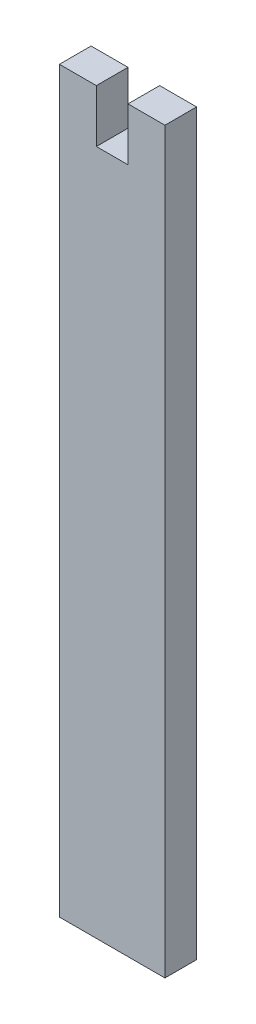
ISO-10303-21;
HEADER;
FILE_DESCRIPTION(('STEP AP214'),'2;1');
FILE_NAME('part.step','',(''),(''),'','','');
FILE_SCHEMA(('AUTOMOTIVE_DESIGN { 1 0 10303 214 1 1 1 1 }'));
ENDSEC;
DATA;
#1=APPLICATION_CONTEXT('core data for automotive mechanical design processes');
#2=APPLICATION_PROTOCOL_DEFINITION('international standard','automotive_design',2000,#1);
#3=PRODUCT_CONTEXT('',#1,'mechanical');
#4=PRODUCT('Part','Part','',(#3));
#5=PRODUCT_RELATED_PRODUCT_CATEGORY('part','',(#4));
#6=PRODUCT_DEFINITION_FORMATION('','',#4);
#7=PRODUCT_DEFINITION_CONTEXT('part definition',#1,'design');
#8=PRODUCT_DEFINITION('design','',#6,#7);
#9=PRODUCT_DEFINITION_SHAPE('','',#8);
#10=(LENGTH_UNIT() NAMED_UNIT(*) SI_UNIT(.MILLI.,.METRE.));
#11=(NAMED_UNIT(*) PLANE_ANGLE_UNIT() SI_UNIT($,.RADIAN.));
#12=(NAMED_UNIT(*) SI_UNIT($,.STERADIAN.) SOLID_ANGLE_UNIT());
#13=UNCERTAINTY_MEASURE_WITH_UNIT(LENGTH_MEASURE(1.E-05),#10,'distance_accuracy_value','');
#14=(GEOMETRIC_REPRESENTATION_CONTEXT(3) GLOBAL_UNCERTAINTY_ASSIGNED_CONTEXT((#13)) GLOBAL_UNIT_ASSIGNED_CONTEXT((#10,
#11,#12)) REPRESENTATION_CONTEXT('',''));
#15=CARTESIAN_POINT('',(0.,0.,0.));
#16=DIRECTION('',(0.,0.,1.));
#17=DIRECTION('',(1.,0.,0.));
#18=AXIS2_PLACEMENT_3D('',#15,#16,#17);
#19=CARTESIAN_POINT('',(0.,35.,1.5));
#20=DIRECTION('',(0.,1.,0.));
#21=DIRECTION('',(0.,0.,1.));
#22=AXIS2_PLACEMENT_3D('',#19,#20,#21);
#23=PLANE('',#22);
#24=DIRECTION('',(1.,0.,0.));
#25=VECTOR('',#24,1.);
#26=CARTESIAN_POINT('',(0.,35.,-1.5));
#27=LINE('',#26,#25);
#28=CARTESIAN_POINT('',(1.5,35.,-1.5));
#29=VERTEX_POINT('',#28);
#30=CARTESIAN_POINT('',(4.99999999999999,35.,-1.5));
#31=VERTEX_POINT('',#30);
#32=EDGE_CURVE('E130',#29,#31,#27,.T.);
#33=ORIENTED_EDGE('',*,*,#32,.F.);
#34=DIRECTION('',(0.,0.,-1.));
#35=VECTOR('',#34,1.);
#36=CARTESIAN_POINT('',(1.5,35.,1.5));
#37=LINE('',#36,#35);
#38=CARTESIAN_POINT('',(1.5,35.,1.5));
#39=VERTEX_POINT('',#38);
#40=EDGE_CURVE('E11',#39,#29,#37,.T.);
#41=ORIENTED_EDGE('',*,*,#40,.F.);
#42=DIRECTION('',(1.,0.,0.));
#43=VECTOR('',#42,1.);
#44=CARTESIAN_POINT('',(0.,35.,1.5));
#45=LINE('',#44,#43);
#46=CARTESIAN_POINT('',(4.99999999999999,35.,1.5));
#47=VERTEX_POINT('',#46);
#48=EDGE_CURVE('E148',#39,#47,#45,.T.);
#49=ORIENTED_EDGE('',*,*,#48,.T.);
#50=DIRECTION('',(0.,0.,-1.));
#51=VECTOR('',#50,1.);
#52=CARTESIAN_POINT('',(4.99999999999999,35.,1.5));
#53=LINE('',#52,#51);
#54=EDGE_CURVE('E52',#47,#31,#53,.T.);
#55=ORIENTED_EDGE('',*,*,#54,.T.);
#56=EDGE_LOOP('',(#33,#41,#49,#55));
#57=FACE_BOUND('',#56,.T.);
#58=ADVANCED_FACE('F35',(#57),#23,.T.);
#59=CARTESIAN_POINT('',(1.5,0.,1.5));
#60=DIRECTION('',(1.,0.,0.));
#61=DIRECTION('',(0.,1.,0.));
#62=AXIS2_PLACEMENT_3D('',#59,#60,#61);
#63=PLANE('',#62);
#64=DIRECTION('',(0.,-1.,0.));
#65=VECTOR('',#64,1.);
#66=CARTESIAN_POINT('',(1.5,0.,-1.5));
#67=LINE('',#66,#65);
#68=CARTESIAN_POINT('',(1.5,30.,-1.5));
#69=VERTEX_POINT('',#68);
#70=EDGE_CURVE('E132',#29,#69,#67,.T.);
#71=ORIENTED_EDGE('',*,*,#70,.T.);
#72=DIRECTION('',(0.,0.,-1.));
#73=VECTOR('',#72,1.);
#74=CARTESIAN_POINT('',(1.5,30.,1.5));
#75=LINE('',#74,#73);
#76=CARTESIAN_POINT('',(1.5,30.,1.5));
#77=VERTEX_POINT('',#76);
#78=EDGE_CURVE('E44',#77,#69,#75,.T.);
#79=ORIENTED_EDGE('',*,*,#78,.F.);
#80=DIRECTION('',(0.,-1.,0.));
#81=VECTOR('',#80,1.);
#82=CARTESIAN_POINT('',(1.5,0.,1.5));
#83=LINE('',#82,#81);
#84=EDGE_CURVE('E173',#39,#77,#83,.T.);
#85=ORIENTED_EDGE('',*,*,#84,.F.);
#86=ORIENTED_EDGE('',*,*,#40,.T.);
#87=EDGE_LOOP('',(#71,#79,#85,#86));
#88=FACE_BOUND('',#87,.T.);
#89=ADVANCED_FACE('F37',(#88),#63,.F.);
#90=CARTESIAN_POINT('',(0.,30.,1.5));
#91=DIRECTION('',(0.,1.,0.));
#92=DIRECTION('',(0.,0.,1.));
#93=AXIS2_PLACEMENT_3D('',#90,#91,#92);
#94=PLANE('',#93);
#95=DIRECTION('',(1.,0.,0.));
#96=VECTOR('',#95,1.);
#97=CARTESIAN_POINT('',(0.,30.,-1.5));
#98=LINE('',#97,#96);
#99=CARTESIAN_POINT('',(-1.5,30.,-1.5));
#100=VERTEX_POINT('',#99);
#101=EDGE_CURVE('E136',#100,#69,#98,.T.);
#102=ORIENTED_EDGE('',*,*,#101,.F.);
#103=DIRECTION('',(0.,0.,-1.));
#104=VECTOR('',#103,1.);
#105=CARTESIAN_POINT('',(-1.5,30.,1.5));
#106=LINE('',#105,#104);
#107=CARTESIAN_POINT('',(-1.5,30.,1.5));
#108=VERTEX_POINT('',#107);
#109=EDGE_CURVE('E154',#108,#100,#106,.T.);
#110=ORIENTED_EDGE('',*,*,#109,.F.);
#111=DIRECTION('',(1.,0.,0.));
#112=VECTOR('',#111,1.);
#113=CARTESIAN_POINT('',(0.,30.,1.5));
#114=LINE('',#113,#112);
#115=EDGE_CURVE('E161',#108,#77,#114,.T.);
#116=ORIENTED_EDGE('',*,*,#115,.T.);
#117=ORIENTED_EDGE('',*,*,#78,.T.);
#118=EDGE_LOOP('',(#102,#110,#116,#117));
#119=FACE_BOUND('',#118,.T.);
#120=ADVANCED_FACE('F159',(#119),#94,.T.);
#121=CARTESIAN_POINT('',(-1.5,0.,1.5));
#122=DIRECTION('',(1.,0.,0.));
#123=DIRECTION('',(0.,1.,0.));
#124=AXIS2_PLACEMENT_3D('',#121,#122,#123);
#125=PLANE('',#124);
#126=DIRECTION('',(0.,-1.,0.));
#127=VECTOR('',#126,1.);
#128=CARTESIAN_POINT('',(-1.5,0.,-1.5));
#129=LINE('',#128,#127);
#130=CARTESIAN_POINT('',(-1.5,35.,-1.5));
#131=VERTEX_POINT('',#130);
#132=EDGE_CURVE('E139',#131,#100,#129,.T.);
#133=ORIENTED_EDGE('',*,*,#132,.F.);
#134=DIRECTION('',(0.,0.,-1.));
#135=VECTOR('',#134,1.);
#136=CARTESIAN_POINT('',(-1.5,35.,1.5));
#137=LINE('',#136,#135);
#138=CARTESIAN_POINT('',(-1.5,35.,1.5));
#139=VERTEX_POINT('',#138);
#140=EDGE_CURVE('E152',#139,#131,#137,.T.);
#141=ORIENTED_EDGE('',*,*,#140,.F.);
#142=DIRECTION('',(0.,-1.,0.));
#143=VECTOR('',#142,1.);
#144=CARTESIAN_POINT('',(-1.5,0.,1.5));
#145=LINE('',#144,#143);
#146=EDGE_CURVE('E172',#139,#108,#145,.T.);
#147=ORIENTED_EDGE('',*,*,#146,.T.);
#148=ORIENTED_EDGE('',*,*,#109,.T.);
#149=EDGE_LOOP('',(#133,#141,#147,#148));
#150=FACE_BOUND('',#149,.T.);
#151=ADVANCED_FACE('F170',(#150),#125,.T.);
#152=CARTESIAN_POINT('',(-5.,35.,-1.5));
#153=VERTEX_POINT('',#152);
#154=EDGE_CURVE('E133',#153,#131,#27,.T.);
#155=ORIENTED_EDGE('',*,*,#154,.F.);
#156=DIRECTION('',(0.,0.,-1.));
#157=VECTOR('',#156,1.);
#158=CARTESIAN_POINT('',(-5.,35.,1.5));
#159=LINE('',#158,#157);
#160=CARTESIAN_POINT('',(-5.,35.,1.5));
#161=VERTEX_POINT('',#160);
#162=EDGE_CURVE('E122',#161,#153,#159,.T.);
#163=ORIENTED_EDGE('',*,*,#162,.F.);
#164=EDGE_CURVE('E112',#161,#139,#45,.T.);
#165=ORIENTED_EDGE('',*,*,#164,.T.);
#166=ORIENTED_EDGE('',*,*,#140,.T.);
#167=EDGE_LOOP('',(#155,#163,#165,#166));
#168=FACE_BOUND('',#167,.T.);
#169=ADVANCED_FACE('F178',(#168),#23,.T.);
#170=CARTESIAN_POINT('',(-5.,0.,1.5));
#171=DIRECTION('',(1.,0.,0.));
#172=DIRECTION('',(0.,1.,0.));
#173=AXIS2_PLACEMENT_3D('',#170,#171,#172);
#174=PLANE('',#173);
#175=DIRECTION('',(0.,-1.,0.));
#176=VECTOR('',#175,1.);
#177=CARTESIAN_POINT('',(-5.,0.,-1.5));
#178=LINE('',#177,#176);
#179=CARTESIAN_POINT('',(-5.,-35.,-1.5));
#180=VERTEX_POINT('',#179);
#181=EDGE_CURVE('E119',#153,#180,#178,.T.);
#182=ORIENTED_EDGE('',*,*,#181,.T.);
#183=DIRECTION('',(0.,0.,-1.));
#184=VECTOR('',#183,1.);
#185=CARTESIAN_POINT('',(-5.,-35.,1.5));
#186=LINE('',#185,#184);
#187=CARTESIAN_POINT('',(-5.,-35.,1.5));
#188=VERTEX_POINT('',#187);
#189=EDGE_CURVE('E116',#188,#180,#186,.T.);
#190=ORIENTED_EDGE('',*,*,#189,.F.);
#191=DIRECTION('',(0.,-1.,0.));
#192=VECTOR('',#191,1.);
#193=CARTESIAN_POINT('',(-5.,0.,1.5));
#194=LINE('',#193,#192);
#195=EDGE_CURVE('E103',#161,#188,#194,.T.);
#196=ORIENTED_EDGE('',*,*,#195,.F.);
#197=ORIENTED_EDGE('',*,*,#162,.T.);
#198=EDGE_LOOP('',(#182,#190,#196,#197));
#199=FACE_BOUND('',#198,.T.);
#200=ADVANCED_FACE('F117',(#199),#174,.F.);
#201=CARTESIAN_POINT('',(0.,-35.,1.5));
#202=DIRECTION('',(0.,1.,0.));
#203=DIRECTION('',(0.,0.,1.));
#204=AXIS2_PLACEMENT_3D('',#201,#202,#203);
#205=PLANE('',#204);
#206=DIRECTION('',(1.,0.,0.));
#207=VECTOR('',#206,1.);
#208=CARTESIAN_POINT('',(0.,-35.,-1.5));
#209=LINE('',#208,#207);
#210=CARTESIAN_POINT('',(5.,-35.,-1.5));
#211=VERTEX_POINT('',#210);
#212=EDGE_CURVE('E143',#180,#211,#209,.T.);
#213=ORIENTED_EDGE('',*,*,#212,.T.);
#214=DIRECTION('',(0.,0.,-1.));
#215=VECTOR('',#214,1.);
#216=CARTESIAN_POINT('',(5.,-35.,1.5));
#217=LINE('',#216,#215);
#218=CARTESIAN_POINT('',(5.,-35.,1.5));
#219=VERTEX_POINT('',#218);
#220=EDGE_CURVE('E78',#219,#211,#217,.T.);
#221=ORIENTED_EDGE('',*,*,#220,.F.);
#222=DIRECTION('',(1.,0.,0.));
#223=VECTOR('',#222,1.);
#224=CARTESIAN_POINT('',(0.,-35.,1.5));
#225=LINE('',#224,#223);
#226=EDGE_CURVE('E109',#188,#219,#225,.T.);
#227=ORIENTED_EDGE('',*,*,#226,.F.);
#228=ORIENTED_EDGE('',*,*,#189,.T.);
#229=EDGE_LOOP('',(#213,#221,#227,#228));
#230=FACE_BOUND('',#229,.T.);
#231=ADVANCED_FACE('F124',(#230),#205,.F.);
#232=CARTESIAN_POINT('',(5.,0.,1.5));
#233=DIRECTION('',(1.,0.,0.));
#234=DIRECTION('',(0.,1.,0.));
#235=AXIS2_PLACEMENT_3D('',#232,#233,#234);
#236=PLANE('',#235);
#237=DIRECTION('',(0.,-1.,0.));
#238=VECTOR('',#237,1.);
#239=CARTESIAN_POINT('',(5.,0.,-1.5));
#240=LINE('',#239,#238);
#241=EDGE_CURVE('E145',#31,#211,#240,.T.);
#242=ORIENTED_EDGE('',*,*,#241,.F.);
#243=ORIENTED_EDGE('',*,*,#54,.F.);
#244=DIRECTION('',(0.,-1.,0.));
#245=VECTOR('',#244,1.);
#246=CARTESIAN_POINT('',(5.,0.,1.5));
#247=LINE('',#246,#245);
#248=EDGE_CURVE('E125',#47,#219,#247,.T.);
#249=ORIENTED_EDGE('',*,*,#248,.T.);
#250=ORIENTED_EDGE('',*,*,#220,.T.);
#251=EDGE_LOOP('',(#242,#243,#249,#250));
#252=FACE_BOUND('',#251,.T.);
#253=ADVANCED_FACE('F179',(#252),#236,.T.);
#254=CARTESIAN_POINT('',(0.,0.,1.5));
#255=DIRECTION('',(0.,0.,1.));
#256=DIRECTION('',(1.,0.,0.));
#257=AXIS2_PLACEMENT_3D('',#254,#255,#256);
#258=PLANE('',#257);
#259=ORIENTED_EDGE('',*,*,#48,.F.);
#260=ORIENTED_EDGE('',*,*,#84,.T.);
#261=ORIENTED_EDGE('',*,*,#115,.F.);
#262=ORIENTED_EDGE('',*,*,#146,.F.);
#263=ORIENTED_EDGE('',*,*,#164,.F.);
#264=ORIENTED_EDGE('',*,*,#195,.T.);
#265=ORIENTED_EDGE('',*,*,#226,.T.);
#266=ORIENTED_EDGE('',*,*,#248,.F.);
#267=EDGE_LOOP('',(#259,#260,#261,#262,#263,#264,#265,#266));
#268=FACE_BOUND('',#267,.T.);
#269=ADVANCED_FACE('F106',(#268),#258,.T.);
#270=CARTESIAN_POINT('',(0.,0.,-1.5));
#271=DIRECTION('',(0.,0.,1.));
#272=DIRECTION('',(1.,0.,0.));
#273=AXIS2_PLACEMENT_3D('',#270,#271,#272);
#274=PLANE('',#273);
#275=ORIENTED_EDGE('',*,*,#32,.T.);
#276=ORIENTED_EDGE('',*,*,#241,.T.);
#277=ORIENTED_EDGE('',*,*,#212,.F.);
#278=ORIENTED_EDGE('',*,*,#181,.F.);
#279=ORIENTED_EDGE('',*,*,#154,.T.);
#280=ORIENTED_EDGE('',*,*,#132,.T.);
#281=ORIENTED_EDGE('',*,*,#101,.T.);
#282=ORIENTED_EDGE('',*,*,#70,.F.);
#283=EDGE_LOOP('',(#275,#276,#277,#278,#279,#280,#281,#282));
#284=FACE_BOUND('',#283,.T.);
#285=ADVANCED_FACE('F165',(#284),#274,.F.);
#286=CLOSED_SHELL('',(#58,#89,#120,#151,#169,#200,#231,#253,#269,#285));
#287=MANIFOLD_SOLID_BREP('B2',#286);
#288=ADVANCED_BREP_SHAPE_REPRESENTATION('',(#18,#287),#14);
#289=SHAPE_DEFINITION_REPRESENTATION(#9,#288);
ENDSEC;
END-ISO-10303-21;
